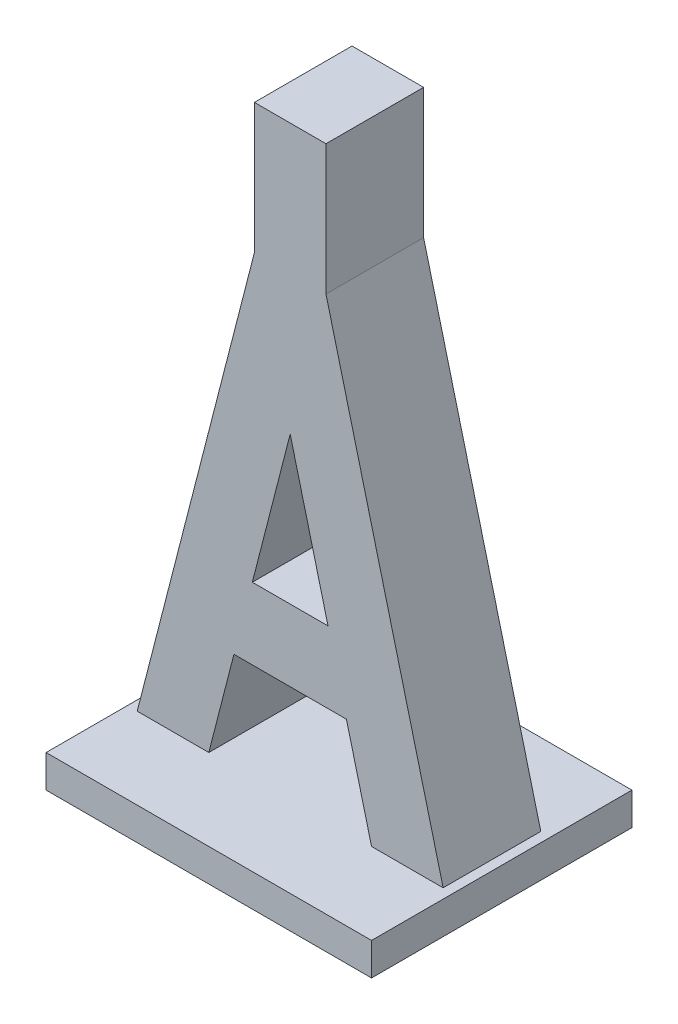
ISO-10303-21;
HEADER;
FILE_DESCRIPTION(('STEP AP214'),'2;1');
FILE_NAME('part.step','',(''),(''),'','','');
FILE_SCHEMA(('AUTOMOTIVE_DESIGN { 1 0 10303 214 1 1 1 1 }'));
ENDSEC;
DATA;
#1=APPLICATION_CONTEXT('core data for automotive mechanical design processes');
#2=APPLICATION_PROTOCOL_DEFINITION('international standard','automotive_design',2000,#1);
#3=PRODUCT_CONTEXT('',#1,'mechanical');
#4=PRODUCT('Part','Part','',(#3));
#5=PRODUCT_RELATED_PRODUCT_CATEGORY('part','',(#4));
#6=PRODUCT_DEFINITION_FORMATION('','',#4);
#7=PRODUCT_DEFINITION_CONTEXT('part definition',#1,'design');
#8=PRODUCT_DEFINITION('design','',#6,#7);
#9=PRODUCT_DEFINITION_SHAPE('','',#8);
#10=(LENGTH_UNIT() NAMED_UNIT(*) SI_UNIT(.MILLI.,.METRE.));
#11=(NAMED_UNIT(*) PLANE_ANGLE_UNIT() SI_UNIT($,.RADIAN.));
#12=(NAMED_UNIT(*) SI_UNIT($,.STERADIAN.) SOLID_ANGLE_UNIT());
#13=UNCERTAINTY_MEASURE_WITH_UNIT(LENGTH_MEASURE(1.E-05),#10,'distance_accuracy_value','');
#14=(GEOMETRIC_REPRESENTATION_CONTEXT(3) GLOBAL_UNCERTAINTY_ASSIGNED_CONTEXT((#13)) GLOBAL_UNIT_ASSIGNED_CONTEXT((#10,
#11,#12)) REPRESENTATION_CONTEXT('',''));
#15=CARTESIAN_POINT('',(0.,0.,0.));
#16=DIRECTION('',(0.,0.,1.));
#17=DIRECTION('',(1.,0.,0.));
#18=AXIS2_PLACEMENT_3D('',#15,#16,#17);
#19=CARTESIAN_POINT('',(0.,0.,15.));
#20=DIRECTION('',(0.,0.,-1.));
#21=DIRECTION('',(-1.,0.,0.));
#22=AXIS2_PLACEMENT_3D('',#19,#20,#21);
#23=PLANE('',#22);
#24=DIRECTION('',(0.249041039810618,0.96849293259685,0.));
#25=VECTOR('',#24,1.);
#26=CARTESIAN_POINT('',(-8.64285714285714,0.,15.));
#27=LINE('',#26,#25);
#28=CARTESIAN_POINT('',(-12.5,-15.,15.));
#29=VERTEX_POINT('',#28);
#30=CARTESIAN_POINT('',(-8.64285714285714,0.,15.));
#31=VERTEX_POINT('',#30);
#32=EDGE_CURVE('E286',#29,#31,#27,.T.);
#33=ORIENTED_EDGE('',*,*,#32,.T.);
#34=DIRECTION('',(1.,0.,0.));
#35=VECTOR('',#34,1.);
#36=CARTESIAN_POINT('',(8.64285714285715,0.,15.));
#37=LINE('',#36,#35);
#38=CARTESIAN_POINT('',(8.64285714285715,0.,15.));
#39=VERTEX_POINT('',#38);
#40=EDGE_CURVE('E290',#31,#39,#37,.T.);
#41=ORIENTED_EDGE('',*,*,#40,.T.);
#42=DIRECTION('',(0.249041039810618,-0.96849293259685,0.));
#43=VECTOR('',#42,1.);
#44=CARTESIAN_POINT('',(8.64285714285715,0.,15.));
#45=LINE('',#44,#43);
#46=CARTESIAN_POINT('',(12.5,-15.,15.));
#47=VERTEX_POINT('',#46);
#48=EDGE_CURVE('E294',#39,#47,#45,.T.);
#49=ORIENTED_EDGE('',*,*,#48,.T.);
#50=DIRECTION('',(1.,0.,0.));
#51=VECTOR('',#50,1.);
#52=CARTESIAN_POINT('',(12.5,-15.,15.));
#53=LINE('',#52,#51);
#54=CARTESIAN_POINT('',(23.5,-15.,15.));
#55=VERTEX_POINT('',#54);
#56=EDGE_CURVE('E298',#47,#55,#53,.T.);
#57=ORIENTED_EDGE('',*,*,#56,.T.);
#58=DIRECTION('',(-0.249041039810619,0.96849293259685,0.));
#59=VECTOR('',#58,1.);
#60=CARTESIAN_POINT('',(23.5,-15.,15.));
#61=LINE('',#60,#59);
#62=CARTESIAN_POINT('',(5.5,55.,15.));
#63=VERTEX_POINT('',#62);
#64=EDGE_CURVE('E302',#55,#63,#61,.T.);
#65=ORIENTED_EDGE('',*,*,#64,.T.);
#66=DIRECTION('',(0.,1.,0.));
#67=VECTOR('',#66,1.);
#68=CARTESIAN_POINT('',(5.5,55.,15.));
#69=LINE('',#68,#67);
#70=CARTESIAN_POINT('',(5.49999999999999,75.,15.));
#71=VERTEX_POINT('',#70);
#72=EDGE_CURVE('E181',#63,#71,#69,.T.);
#73=ORIENTED_EDGE('',*,*,#72,.T.);
#74=DIRECTION('',(-1.,0.,0.));
#75=VECTOR('',#74,1.);
#76=CARTESIAN_POINT('',(-5.50000000000001,75.,15.));
#77=LINE('',#76,#75);
#78=CARTESIAN_POINT('',(-5.50000000000001,75.,15.));
#79=VERTEX_POINT('',#78);
#80=EDGE_CURVE('E199',#71,#79,#77,.T.);
#81=ORIENTED_EDGE('',*,*,#80,.T.);
#82=DIRECTION('',(0.,-1.,0.));
#83=VECTOR('',#82,1.);
#84=CARTESIAN_POINT('',(-5.5,55.,15.));
#85=LINE('',#84,#83);
#86=CARTESIAN_POINT('',(-5.5,55.,15.));
#87=VERTEX_POINT('',#86);
#88=EDGE_CURVE('E202',#79,#87,#85,.T.);
#89=ORIENTED_EDGE('',*,*,#88,.T.);
#90=DIRECTION('',(-0.249041039810618,-0.96849293259685,0.));
#91=VECTOR('',#90,1.);
#92=CARTESIAN_POINT('',(-23.5,-15.,15.));
#93=LINE('',#92,#91);
#94=CARTESIAN_POINT('',(-23.5,-15.,15.));
#95=VERTEX_POINT('',#94);
#96=EDGE_CURVE('E305',#87,#95,#93,.T.);
#97=ORIENTED_EDGE('',*,*,#96,.T.);
#98=DIRECTION('',(1.,0.,0.));
#99=VECTOR('',#98,1.);
#100=CARTESIAN_POINT('',(-12.5,-15.,15.));
#101=LINE('',#100,#99);
#102=EDGE_CURVE('E308',#95,#29,#101,.T.);
#103=ORIENTED_EDGE('',*,*,#102,.T.);
#104=EDGE_LOOP('',(#33,#41,#49,#57,#65,#73,#81,#89,#97,#103));
#105=FACE_BOUND('',#104,.T.);
#106=DIRECTION('',(-0.249041039810618,0.96849293259685,0.));
#107=VECTOR('',#106,1.);
#108=CARTESIAN_POINT('',(0.,33.6111111111111,15.));
#109=LINE('',#108,#107);
#110=CARTESIAN_POINT('',(5.81428571428572,11.,15.));
#111=VERTEX_POINT('',#110);
#112=CARTESIAN_POINT('',(0.,33.6111111111111,15.));
#113=VERTEX_POINT('',#112);
#114=EDGE_CURVE('E258',#111,#113,#109,.T.);
#115=ORIENTED_EDGE('',*,*,#114,.F.);
#116=DIRECTION('',(1.,0.,0.));
#117=VECTOR('',#116,1.);
#118=CARTESIAN_POINT('',(-5.81428571428571,11.,15.));
#119=LINE('',#118,#117);
#120=CARTESIAN_POINT('',(-5.81428571428571,11.,15.));
#121=VERTEX_POINT('',#120);
#122=EDGE_CURVE('E265',#121,#111,#119,.T.);
#123=ORIENTED_EDGE('',*,*,#122,.F.);
#124=DIRECTION('',(-0.249041039810618,-0.96849293259685,0.));
#125=VECTOR('',#124,1.);
#126=CARTESIAN_POINT('',(0.,33.6111111111111,15.));
#127=LINE('',#126,#125);
#128=EDGE_CURVE('E261',#113,#121,#127,.T.);
#129=ORIENTED_EDGE('',*,*,#128,.F.);
#130=EDGE_LOOP('',(#115,#123,#129));
#131=FACE_BOUND('',#130,.T.);
#132=ADVANCED_FACE('F38',(#105,#131),#23,.F.);
#133=CARTESIAN_POINT('',(0.,0.,0.));
#134=DIRECTION('',(0.,0.,-1.));
#135=DIRECTION('',(-1.,0.,0.));
#136=AXIS2_PLACEMENT_3D('',#133,#134,#135);
#137=PLANE('',#136);
#138=DIRECTION('',(0.249041039810618,0.96849293259685,0.));
#139=VECTOR('',#138,1.);
#140=CARTESIAN_POINT('',(-8.64285714285714,0.,0.));
#141=LINE('',#140,#139);
#142=CARTESIAN_POINT('',(-12.5,-15.,0.));
#143=VERTEX_POINT('',#142);
#144=CARTESIAN_POINT('',(-8.64285714285714,0.,0.));
#145=VERTEX_POINT('',#144);
#146=EDGE_CURVE('E285',#143,#145,#141,.T.);
#147=ORIENTED_EDGE('',*,*,#146,.F.);
#148=DIRECTION('',(1.,0.,0.));
#149=VECTOR('',#148,1.);
#150=CARTESIAN_POINT('',(-12.5,-15.,0.));
#151=LINE('',#150,#149);
#152=CARTESIAN_POINT('',(-23.5,-15.,0.));
#153=VERTEX_POINT('',#152);
#154=EDGE_CURVE('E291',#153,#143,#151,.T.);
#155=ORIENTED_EDGE('',*,*,#154,.F.);
#156=DIRECTION('',(-0.249041039810618,-0.96849293259685,0.));
#157=VECTOR('',#156,1.);
#158=CARTESIAN_POINT('',(-23.5,-15.,0.));
#159=LINE('',#158,#157);
#160=CARTESIAN_POINT('',(-5.5,55.,0.));
#161=VERTEX_POINT('',#160);
#162=EDGE_CURVE('E172',#161,#153,#159,.T.);
#163=ORIENTED_EDGE('',*,*,#162,.F.);
#164=DIRECTION('',(0.,-1.,0.));
#165=VECTOR('',#164,1.);
#166=CARTESIAN_POINT('',(-5.5,55.,0.));
#167=LINE('',#166,#165);
#168=CARTESIAN_POINT('',(-5.50000000000001,75.,0.));
#169=VERTEX_POINT('',#168);
#170=EDGE_CURVE('E192',#169,#161,#167,.T.);
#171=ORIENTED_EDGE('',*,*,#170,.F.);
#172=DIRECTION('',(-1.,0.,0.));
#173=VECTOR('',#172,1.);
#174=CARTESIAN_POINT('',(-5.50000000000001,75.,0.));
#175=LINE('',#174,#173);
#176=CARTESIAN_POINT('',(5.49999999999999,75.,0.));
#177=VERTEX_POINT('',#176);
#178=EDGE_CURVE('E190',#177,#169,#175,.T.);
#179=ORIENTED_EDGE('',*,*,#178,.F.);
#180=DIRECTION('',(0.,1.,0.));
#181=VECTOR('',#180,1.);
#182=CARTESIAN_POINT('',(5.5,55.,0.));
#183=LINE('',#182,#181);
#184=CARTESIAN_POINT('',(5.5,55.,0.));
#185=VERTEX_POINT('',#184);
#186=EDGE_CURVE('E178',#185,#177,#183,.T.);
#187=ORIENTED_EDGE('',*,*,#186,.F.);
#188=DIRECTION('',(-0.249041039810619,0.96849293259685,0.));
#189=VECTOR('',#188,1.);
#190=CARTESIAN_POINT('',(23.5,-15.,0.));
#191=LINE('',#190,#189);
#192=CARTESIAN_POINT('',(23.5,-15.,0.));
#193=VERTEX_POINT('',#192);
#194=EDGE_CURVE('E161',#193,#185,#191,.T.);
#195=ORIENTED_EDGE('',*,*,#194,.F.);
#196=DIRECTION('',(1.,0.,0.));
#197=VECTOR('',#196,1.);
#198=CARTESIAN_POINT('',(12.5,-15.,0.));
#199=LINE('',#198,#197);
#200=CARTESIAN_POINT('',(12.5,-15.,0.));
#201=VERTEX_POINT('',#200);
#202=EDGE_CURVE('E173',#201,#193,#199,.T.);
#203=ORIENTED_EDGE('',*,*,#202,.F.);
#204=DIRECTION('',(0.249041039810618,-0.96849293259685,0.));
#205=VECTOR('',#204,1.);
#206=CARTESIAN_POINT('',(8.64285714285715,0.,0.));
#207=LINE('',#206,#205);
#208=CARTESIAN_POINT('',(8.64285714285715,0.,0.));
#209=VERTEX_POINT('',#208);
#210=EDGE_CURVE('E318',#209,#201,#207,.T.);
#211=ORIENTED_EDGE('',*,*,#210,.F.);
#212=DIRECTION('',(1.,0.,0.));
#213=VECTOR('',#212,1.);
#214=CARTESIAN_POINT('',(8.64285714285715,0.,0.));
#215=LINE('',#214,#213);
#216=EDGE_CURVE('E315',#145,#209,#215,.T.);
#217=ORIENTED_EDGE('',*,*,#216,.F.);
#218=EDGE_LOOP('',(#147,#155,#163,#171,#179,#187,#195,#203,#211,#217));
#219=FACE_BOUND('',#218,.T.);
#220=DIRECTION('',(1.,0.,0.));
#221=VECTOR('',#220,1.);
#222=CARTESIAN_POINT('',(-5.81428571428571,11.,0.));
#223=LINE('',#222,#221);
#224=CARTESIAN_POINT('',(-5.81428571428571,11.,0.));
#225=VERTEX_POINT('',#224);
#226=CARTESIAN_POINT('',(5.81428571428572,11.,0.));
#227=VERTEX_POINT('',#226);
#228=EDGE_CURVE('E262',#225,#227,#223,.T.);
#229=ORIENTED_EDGE('',*,*,#228,.T.);
#230=DIRECTION('',(-0.249041039810618,0.96849293259685,0.));
#231=VECTOR('',#230,1.);
#232=CARTESIAN_POINT('',(0.,33.6111111111111,0.));
#233=LINE('',#232,#231);
#234=CARTESIAN_POINT('',(0.,33.6111111111111,0.));
#235=VERTEX_POINT('',#234);
#236=EDGE_CURVE('E62',#227,#235,#233,.T.);
#237=ORIENTED_EDGE('',*,*,#236,.T.);
#238=DIRECTION('',(-0.249041039810618,-0.96849293259685,0.));
#239=VECTOR('',#238,1.);
#240=CARTESIAN_POINT('',(0.,33.6111111111111,0.));
#241=LINE('',#240,#239);
#242=EDGE_CURVE('E271',#235,#225,#241,.T.);
#243=ORIENTED_EDGE('',*,*,#242,.T.);
#244=EDGE_LOOP('',(#229,#237,#243));
#245=FACE_BOUND('',#244,.T.);
#246=ADVANCED_FACE('F186',(#219,#245),#137,.T.);
#247=CARTESIAN_POINT('',(-8.64285714285714,0.,15.));
#248=DIRECTION('',(-0.96849293259685,0.249041039810618,0.));
#249=DIRECTION('',(-0.249041039810618,-0.96849293259685,0.));
#250=AXIS2_PLACEMENT_3D('',#247,#248,#249);
#251=PLANE('',#250);
#252=ORIENTED_EDGE('',*,*,#146,.T.);
#253=DIRECTION('',(0.,0.,-1.));
#254=VECTOR('',#253,1.);
#255=CARTESIAN_POINT('',(-8.64285714285714,0.,15.));
#256=LINE('',#255,#254);
#257=EDGE_CURVE('E11',#31,#145,#256,.T.);
#258=ORIENTED_EDGE('',*,*,#257,.F.);
#259=ORIENTED_EDGE('',*,*,#32,.F.);
#260=DIRECTION('',(0.,0.,-1.));
#261=VECTOR('',#260,1.);
#262=CARTESIAN_POINT('',(-12.5,-15.,15.));
#263=LINE('',#262,#261);
#264=EDGE_CURVE('E311',#29,#143,#263,.T.);
#265=ORIENTED_EDGE('',*,*,#264,.T.);
#266=EDGE_LOOP('',(#252,#258,#259,#265));
#267=FACE_BOUND('',#266,.T.);
#268=ADVANCED_FACE('F40',(#267),#251,.F.);
#269=CARTESIAN_POINT('',(8.64285714285715,0.,15.));
#270=DIRECTION('',(0.,1.,0.));
#271=DIRECTION('',(-1.,0.,0.));
#272=AXIS2_PLACEMENT_3D('',#269,#270,#271);
#273=PLANE('',#272);
#274=ORIENTED_EDGE('',*,*,#216,.T.);
#275=DIRECTION('',(0.,0.,-1.));
#276=VECTOR('',#275,1.);
#277=CARTESIAN_POINT('',(8.64285714285715,0.,15.));
#278=LINE('',#277,#276);
#279=EDGE_CURVE('E47',#39,#209,#278,.T.);
#280=ORIENTED_EDGE('',*,*,#279,.F.);
#281=ORIENTED_EDGE('',*,*,#40,.F.);
#282=ORIENTED_EDGE('',*,*,#257,.T.);
#283=EDGE_LOOP('',(#274,#280,#281,#282));
#284=FACE_BOUND('',#283,.T.);
#285=ADVANCED_FACE('F357',(#284),#273,.F.);
#286=CARTESIAN_POINT('',(8.64285714285715,0.,15.));
#287=DIRECTION('',(0.96849293259685,0.249041039810618,0.));
#288=DIRECTION('',(-0.249041039810618,0.96849293259685,0.));
#289=AXIS2_PLACEMENT_3D('',#286,#287,#288);
#290=PLANE('',#289);
#291=ORIENTED_EDGE('',*,*,#210,.T.);
#292=DIRECTION('',(0.,0.,-1.));
#293=VECTOR('',#292,1.);
#294=CARTESIAN_POINT('',(12.5,-15.,15.));
#295=LINE('',#294,#293);
#296=EDGE_CURVE('E340',#47,#201,#295,.T.);
#297=ORIENTED_EDGE('',*,*,#296,.F.);
#298=ORIENTED_EDGE('',*,*,#48,.F.);
#299=ORIENTED_EDGE('',*,*,#279,.T.);
#300=EDGE_LOOP('',(#291,#297,#298,#299));
#301=FACE_BOUND('',#300,.T.);
#302=ADVANCED_FACE('F348',(#301),#290,.F.);
#303=CARTESIAN_POINT('',(23.5,-15.,15.));
#304=DIRECTION('',(-0.96849293259685,-0.249041039810619,0.));
#305=DIRECTION('',(0.249041039810619,-0.96849293259685,0.));
#306=AXIS2_PLACEMENT_3D('',#303,#304,#305);
#307=PLANE('',#306);
#308=ORIENTED_EDGE('',*,*,#194,.T.);
#309=DIRECTION('',(0.,0.,-1.));
#310=VECTOR('',#309,1.);
#311=CARTESIAN_POINT('',(5.5,55.,15.));
#312=LINE('',#311,#310);
#313=EDGE_CURVE('E165',#63,#185,#312,.T.);
#314=ORIENTED_EDGE('',*,*,#313,.F.);
#315=ORIENTED_EDGE('',*,*,#64,.F.);
#316=DIRECTION('',(0.,0.,-1.));
#317=VECTOR('',#316,1.);
#318=CARTESIAN_POINT('',(23.5,-15.,15.));
#319=LINE('',#318,#317);
#320=EDGE_CURVE('E167',#55,#193,#319,.T.);
#321=ORIENTED_EDGE('',*,*,#320,.T.);
#322=EDGE_LOOP('',(#308,#314,#315,#321));
#323=FACE_BOUND('',#322,.T.);
#324=ADVANCED_FACE('F163',(#323),#307,.F.);
#325=CARTESIAN_POINT('',(-23.5,-15.,15.));
#326=DIRECTION('',(0.96849293259685,-0.249041039810618,0.));
#327=DIRECTION('',(0.249041039810618,0.96849293259685,0.));
#328=AXIS2_PLACEMENT_3D('',#325,#326,#327);
#329=PLANE('',#328);
#330=ORIENTED_EDGE('',*,*,#162,.T.);
#331=DIRECTION('',(0.,0.,-1.));
#332=VECTOR('',#331,1.);
#333=CARTESIAN_POINT('',(-23.5,-15.,15.));
#334=LINE('',#333,#332);
#335=EDGE_CURVE('E332',#95,#153,#334,.T.);
#336=ORIENTED_EDGE('',*,*,#335,.F.);
#337=ORIENTED_EDGE('',*,*,#96,.F.);
#338=DIRECTION('',(0.,0.,-1.));
#339=VECTOR('',#338,1.);
#340=CARTESIAN_POINT('',(-5.5,55.,15.));
#341=LINE('',#340,#339);
#342=EDGE_CURVE('E183',#87,#161,#341,.T.);
#343=ORIENTED_EDGE('',*,*,#342,.T.);
#344=EDGE_LOOP('',(#330,#336,#337,#343));
#345=FACE_BOUND('',#344,.T.);
#346=ADVANCED_FACE('F365',(#345),#329,.F.);
#347=CARTESIAN_POINT('',(0.,33.6111111111111,15.));
#348=DIRECTION('',(-0.96849293259685,-0.249041039810618,0.));
#349=DIRECTION('',(0.249041039810618,-0.96849293259685,0.));
#350=AXIS2_PLACEMENT_3D('',#347,#348,#349);
#351=PLANE('',#350);
#352=ORIENTED_EDGE('',*,*,#236,.F.);
#353=DIRECTION('',(0.,0.,-1.));
#354=VECTOR('',#353,1.);
#355=CARTESIAN_POINT('',(5.81428571428572,11.,15.));
#356=LINE('',#355,#354);
#357=EDGE_CURVE('E268',#111,#227,#356,.T.);
#358=ORIENTED_EDGE('',*,*,#357,.F.);
#359=ORIENTED_EDGE('',*,*,#114,.T.);
#360=DIRECTION('',(0.,0.,-1.));
#361=VECTOR('',#360,1.);
#362=CARTESIAN_POINT('',(0.,33.6111111111111,15.));
#363=LINE('',#362,#361);
#364=EDGE_CURVE('E282',#113,#235,#363,.T.);
#365=ORIENTED_EDGE('',*,*,#364,.T.);
#366=EDGE_LOOP('',(#352,#358,#359,#365));
#367=FACE_BOUND('',#366,.T.);
#368=ADVANCED_FACE('F389',(#367),#351,.T.);
#369=CARTESIAN_POINT('',(0.,33.6111111111111,15.));
#370=DIRECTION('',(0.96849293259685,-0.249041039810618,0.));
#371=DIRECTION('',(0.249041039810618,0.96849293259685,0.));
#372=AXIS2_PLACEMENT_3D('',#369,#370,#371);
#373=PLANE('',#372);
#374=ORIENTED_EDGE('',*,*,#242,.F.);
#375=ORIENTED_EDGE('',*,*,#364,.F.);
#376=ORIENTED_EDGE('',*,*,#128,.T.);
#377=DIRECTION('',(0.,0.,-1.));
#378=VECTOR('',#377,1.);
#379=CARTESIAN_POINT('',(-5.81428571428571,11.,15.));
#380=LINE('',#379,#378);
#381=EDGE_CURVE('E54',#121,#225,#380,.T.);
#382=ORIENTED_EDGE('',*,*,#381,.T.);
#383=EDGE_LOOP('',(#374,#375,#376,#382));
#384=FACE_BOUND('',#383,.T.);
#385=ADVANCED_FACE('F497',(#384),#373,.T.);
#386=CARTESIAN_POINT('',(-5.81428571428571,11.,15.));
#387=DIRECTION('',(0.,1.,0.));
#388=DIRECTION('',(-1.,0.,0.));
#389=AXIS2_PLACEMENT_3D('',#386,#387,#388);
#390=PLANE('',#389);
#391=ORIENTED_EDGE('',*,*,#228,.F.);
#392=ORIENTED_EDGE('',*,*,#381,.F.);
#393=ORIENTED_EDGE('',*,*,#122,.T.);
#394=ORIENTED_EDGE('',*,*,#357,.T.);
#395=EDGE_LOOP('',(#391,#392,#393,#394));
#396=FACE_BOUND('',#395,.T.);
#397=ADVANCED_FACE('F490',(#396),#390,.T.);
#398=CARTESIAN_POINT('',(0.,-15.,0.));
#399=DIRECTION('',(0.,-1.,0.));
#400=DIRECTION('',(1.,0.,0.));
#401=AXIS2_PLACEMENT_3D('',#398,#399,#400);
#402=PLANE('',#401);
#403=DIRECTION('',(0.,0.,-1.));
#404=VECTOR('',#403,1.);
#405=CARTESIAN_POINT('',(-25.,-15.,27.5));
#406=LINE('',#405,#404);
#407=CARTESIAN_POINT('',(-25.,-15.,27.5));
#408=VERTEX_POINT('',#407);
#409=CARTESIAN_POINT('',(-25.,-15.,-12.5));
#410=VERTEX_POINT('',#409);
#411=EDGE_CURVE('E214',#408,#410,#406,.T.);
#412=ORIENTED_EDGE('',*,*,#411,.F.);
#413=DIRECTION('',(-1.,0.,0.));
#414=VECTOR('',#413,1.);
#415=CARTESIAN_POINT('',(-25.,-15.,27.5));
#416=LINE('',#415,#414);
#417=CARTESIAN_POINT('',(25.,-15.,27.5));
#418=VERTEX_POINT('',#417);
#419=EDGE_CURVE('E222',#418,#408,#416,.T.);
#420=ORIENTED_EDGE('',*,*,#419,.F.);
#421=DIRECTION('',(0.,0.,1.));
#422=VECTOR('',#421,1.);
#423=CARTESIAN_POINT('',(25.,-15.,27.5));
#424=LINE('',#423,#422);
#425=CARTESIAN_POINT('',(25.,-15.,-12.5));
#426=VERTEX_POINT('',#425);
#427=EDGE_CURVE('E238',#426,#418,#424,.T.);
#428=ORIENTED_EDGE('',*,*,#427,.F.);
#429=DIRECTION('',(1.,0.,0.));
#430=VECTOR('',#429,1.);
#431=CARTESIAN_POINT('',(-25.,-15.,-12.5));
#432=LINE('',#431,#430);
#433=EDGE_CURVE('E235',#410,#426,#432,.T.);
#434=ORIENTED_EDGE('',*,*,#433,.F.);
#435=EDGE_LOOP('',(#412,#420,#428,#434));
#436=FACE_BOUND('',#435,.T.);
#437=ORIENTED_EDGE('',*,*,#154,.T.);
#438=ORIENTED_EDGE('',*,*,#264,.F.);
#439=ORIENTED_EDGE('',*,*,#102,.F.);
#440=ORIENTED_EDGE('',*,*,#335,.T.);
#441=EDGE_LOOP('',(#437,#438,#439,#440));
#442=FACE_BOUND('',#441,.T.);
#443=ORIENTED_EDGE('',*,*,#56,.F.);
#444=ORIENTED_EDGE('',*,*,#296,.T.);
#445=ORIENTED_EDGE('',*,*,#202,.T.);
#446=ORIENTED_EDGE('',*,*,#320,.F.);
#447=EDGE_LOOP('',(#443,#444,#445,#446));
#448=FACE_BOUND('',#447,.T.);
#449=ADVANCED_FACE('F352',(#436,#442,#448),#402,.F.);
#450=CARTESIAN_POINT('',(-25.,-20.,27.5));
#451=DIRECTION('',(1.,0.,0.));
#452=DIRECTION('',(0.,0.,-1.));
#453=AXIS2_PLACEMENT_3D('',#450,#451,#452);
#454=PLANE('',#453);
#455=ORIENTED_EDGE('',*,*,#411,.T.);
#456=DIRECTION('',(0.,1.,0.));
#457=VECTOR('',#456,1.);
#458=CARTESIAN_POINT('',(-25.,-20.,-12.5));
#459=LINE('',#458,#457);
#460=CARTESIAN_POINT('',(-25.,-20.,-12.5));
#461=VERTEX_POINT('',#460);
#462=EDGE_CURVE('E254',#461,#410,#459,.T.);
#463=ORIENTED_EDGE('',*,*,#462,.F.);
#464=DIRECTION('',(0.,0.,-1.));
#465=VECTOR('',#464,1.);
#466=CARTESIAN_POINT('',(-25.,-20.,27.5));
#467=LINE('',#466,#465);
#468=CARTESIAN_POINT('',(-25.,-20.,27.5));
#469=VERTEX_POINT('',#468);
#470=EDGE_CURVE('E217',#469,#461,#467,.T.);
#471=ORIENTED_EDGE('',*,*,#470,.F.);
#472=DIRECTION('',(0.,1.,0.));
#473=VECTOR('',#472,1.);
#474=CARTESIAN_POINT('',(-25.,-20.,27.5));
#475=LINE('',#474,#473);
#476=EDGE_CURVE('E231',#469,#408,#475,.T.);
#477=ORIENTED_EDGE('',*,*,#476,.T.);
#478=EDGE_LOOP('',(#455,#463,#471,#477));
#479=FACE_BOUND('',#478,.T.);
#480=ADVANCED_FACE('F475',(#479),#454,.F.);
#481=CARTESIAN_POINT('',(-25.,-20.,-12.5));
#482=DIRECTION('',(0.,0.,1.));
#483=DIRECTION('',(1.,0.,0.));
#484=AXIS2_PLACEMENT_3D('',#481,#482,#483);
#485=PLANE('',#484);
#486=ORIENTED_EDGE('',*,*,#433,.T.);
#487=DIRECTION('',(0.,1.,0.));
#488=VECTOR('',#487,1.);
#489=CARTESIAN_POINT('',(25.,-20.,-12.5));
#490=LINE('',#489,#488);
#491=CARTESIAN_POINT('',(25.,-20.,-12.5));
#492=VERTEX_POINT('',#491);
#493=EDGE_CURVE('E250',#492,#426,#490,.T.);
#494=ORIENTED_EDGE('',*,*,#493,.F.);
#495=DIRECTION('',(1.,0.,0.));
#496=VECTOR('',#495,1.);
#497=CARTESIAN_POINT('',(-25.,-20.,-12.5));
#498=LINE('',#497,#496);
#499=EDGE_CURVE('E221',#461,#492,#498,.T.);
#500=ORIENTED_EDGE('',*,*,#499,.F.);
#501=ORIENTED_EDGE('',*,*,#462,.T.);
#502=EDGE_LOOP('',(#486,#494,#500,#501));
#503=FACE_BOUND('',#502,.T.);
#504=ADVANCED_FACE('F467',(#503),#485,.F.);
#505=CARTESIAN_POINT('',(25.,-20.,27.5));
#506=DIRECTION('',(-1.,0.,0.));
#507=DIRECTION('',(0.,-1.,0.));
#508=AXIS2_PLACEMENT_3D('',#505,#506,#507);
#509=PLANE('',#508);
#510=ORIENTED_EDGE('',*,*,#427,.T.);
#511=DIRECTION('',(0.,1.,0.));
#512=VECTOR('',#511,1.);
#513=CARTESIAN_POINT('',(25.,-20.,27.5));
#514=LINE('',#513,#512);
#515=CARTESIAN_POINT('',(25.,-20.,27.5));
#516=VERTEX_POINT('',#515);
#517=EDGE_CURVE('E246',#516,#418,#514,.T.);
#518=ORIENTED_EDGE('',*,*,#517,.F.);
#519=DIRECTION('',(0.,0.,1.));
#520=VECTOR('',#519,1.);
#521=CARTESIAN_POINT('',(25.,-20.,27.5));
#522=LINE('',#521,#520);
#523=EDGE_CURVE('E225',#492,#516,#522,.T.);
#524=ORIENTED_EDGE('',*,*,#523,.F.);
#525=ORIENTED_EDGE('',*,*,#493,.T.);
#526=EDGE_LOOP('',(#510,#518,#524,#525));
#527=FACE_BOUND('',#526,.T.);
#528=ADVANCED_FACE('F459',(#527),#509,.F.);
#529=CARTESIAN_POINT('',(-25.,-20.,27.5));
#530=DIRECTION('',(0.,0.,-1.));
#531=DIRECTION('',(-1.,0.,0.));
#532=AXIS2_PLACEMENT_3D('',#529,#530,#531);
#533=PLANE('',#532);
#534=ORIENTED_EDGE('',*,*,#419,.T.);
#535=ORIENTED_EDGE('',*,*,#476,.F.);
#536=DIRECTION('',(-1.,0.,0.));
#537=VECTOR('',#536,1.);
#538=CARTESIAN_POINT('',(-25.,-20.,27.5));
#539=LINE('',#538,#537);
#540=EDGE_CURVE('E228',#516,#469,#539,.T.);
#541=ORIENTED_EDGE('',*,*,#540,.F.);
#542=ORIENTED_EDGE('',*,*,#517,.T.);
#543=EDGE_LOOP('',(#534,#535,#541,#542));
#544=FACE_BOUND('',#543,.T.);
#545=ADVANCED_FACE('F451',(#544),#533,.F.);
#546=CARTESIAN_POINT('',(0.,-20.,0.));
#547=DIRECTION('',(0.,-1.,0.));
#548=DIRECTION('',(1.,0.,0.));
#549=AXIS2_PLACEMENT_3D('',#546,#547,#548);
#550=PLANE('',#549);
#551=ORIENTED_EDGE('',*,*,#470,.T.);
#552=ORIENTED_EDGE('',*,*,#499,.T.);
#553=ORIENTED_EDGE('',*,*,#523,.T.);
#554=ORIENTED_EDGE('',*,*,#540,.T.);
#555=EDGE_LOOP('',(#551,#552,#553,#554));
#556=FACE_BOUND('',#555,.T.);
#557=ADVANCED_FACE('F380',(#556),#550,.T.);
#558=CARTESIAN_POINT('',(-5.5,55.,0.));
#559=DIRECTION('',(-1.,0.,0.));
#560=DIRECTION('',(0.,-1.,0.));
#561=AXIS2_PLACEMENT_3D('',#558,#559,#560);
#562=PLANE('',#561);
#563=ORIENTED_EDGE('',*,*,#88,.F.);
#564=DIRECTION('',(0.,0.,1.));
#565=VECTOR('',#564,1.);
#566=CARTESIAN_POINT('',(-5.50000000000001,75.,0.));
#567=LINE('',#566,#565);
#568=EDGE_CURVE('E211',#169,#79,#567,.T.);
#569=ORIENTED_EDGE('',*,*,#568,.F.);
#570=ORIENTED_EDGE('',*,*,#170,.T.);
#571=ORIENTED_EDGE('',*,*,#342,.F.);
#572=EDGE_LOOP('',(#563,#569,#570,#571));
#573=FACE_BOUND('',#572,.T.);
#574=ADVANCED_FACE('F369',(#573),#562,.T.);
#575=CARTESIAN_POINT('',(-5.50000000000001,75.,0.));
#576=DIRECTION('',(0.,1.,0.));
#577=DIRECTION('',(0.,0.,1.));
#578=AXIS2_PLACEMENT_3D('',#575,#576,#577);
#579=PLANE('',#578);
#580=ORIENTED_EDGE('',*,*,#80,.F.);
#581=DIRECTION('',(0.,0.,1.));
#582=VECTOR('',#581,1.);
#583=CARTESIAN_POINT('',(5.49999999999999,75.,0.));
#584=LINE('',#583,#582);
#585=EDGE_CURVE('E196',#177,#71,#584,.T.);
#586=ORIENTED_EDGE('',*,*,#585,.F.);
#587=ORIENTED_EDGE('',*,*,#178,.T.);
#588=ORIENTED_EDGE('',*,*,#568,.T.);
#589=EDGE_LOOP('',(#580,#586,#587,#588));
#590=FACE_BOUND('',#589,.T.);
#591=ADVANCED_FACE('F372',(#590),#579,.T.);
#592=CARTESIAN_POINT('',(5.5,55.,0.));
#593=DIRECTION('',(1.,0.,0.));
#594=DIRECTION('',(0.,1.,0.));
#595=AXIS2_PLACEMENT_3D('',#592,#593,#594);
#596=PLANE('',#595);
#597=ORIENTED_EDGE('',*,*,#72,.F.);
#598=ORIENTED_EDGE('',*,*,#313,.T.);
#599=ORIENTED_EDGE('',*,*,#186,.T.);
#600=ORIENTED_EDGE('',*,*,#585,.T.);
#601=EDGE_LOOP('',(#597,#598,#599,#600));
#602=FACE_BOUND('',#601,.T.);
#603=ADVANCED_FACE('F177',(#602),#596,.T.);
#604=CLOSED_SHELL('',(#132,#246,#268,#285,#302,#324,#346,#368,#385,#397,#449,#480,#504,#528,
#545,#557,#574,#591,#603));
#605=MANIFOLD_SOLID_BREP('B2',#604);
#606=ADVANCED_BREP_SHAPE_REPRESENTATION('',(#18,#605),#14);
#607=SHAPE_DEFINITION_REPRESENTATION(#9,#606);
ENDSEC;
END-ISO-10303-21;
